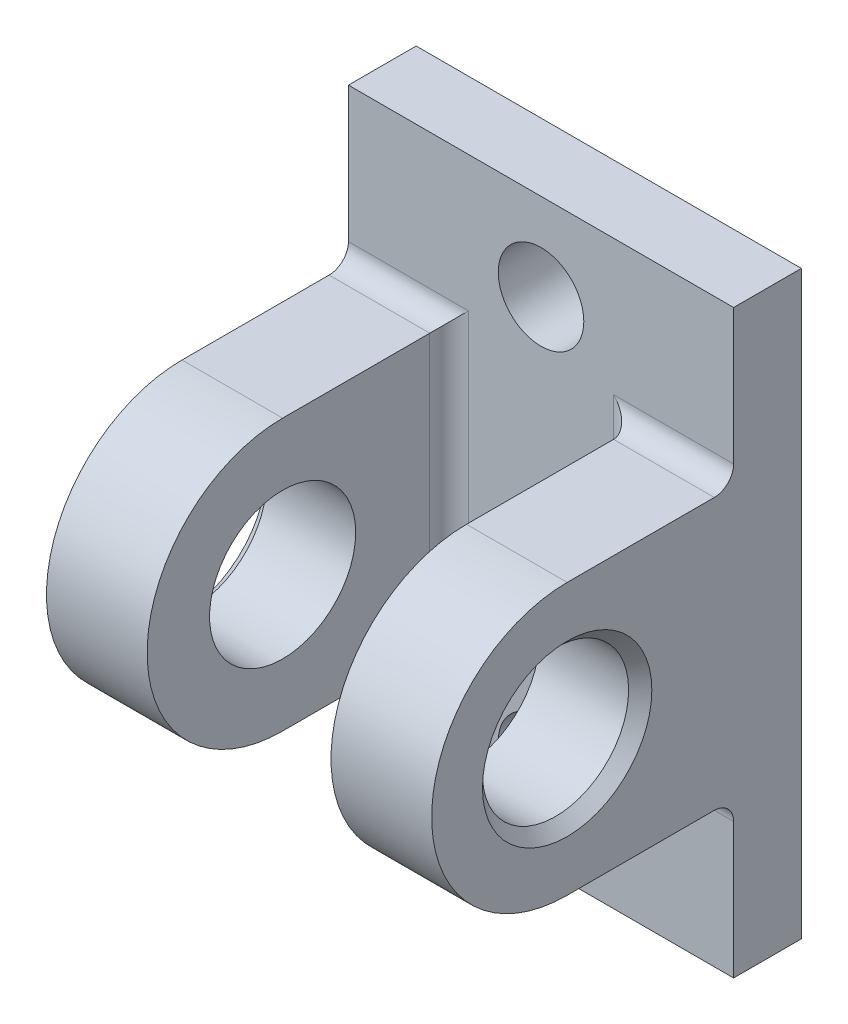
ISO-10303-21;
HEADER;
FILE_DESCRIPTION(('STEP AP214'),'2;1');
FILE_NAME('part.step','',(''),(''),'','','');
FILE_SCHEMA(('AUTOMOTIVE_DESIGN { 1 0 10303 214 1 1 1 1 }'));
ENDSEC;
DATA;
#1=APPLICATION_CONTEXT('core data for automotive mechanical design processes');
#2=APPLICATION_PROTOCOL_DEFINITION('international standard','automotive_design',2000,#1);
#3=PRODUCT_CONTEXT('',#1,'mechanical');
#4=PRODUCT('Part','Part','',(#3));
#5=PRODUCT_RELATED_PRODUCT_CATEGORY('part','',(#4));
#6=PRODUCT_DEFINITION_FORMATION('','',#4);
#7=PRODUCT_DEFINITION_CONTEXT('part definition',#1,'design');
#8=PRODUCT_DEFINITION('design','',#6,#7);
#9=PRODUCT_DEFINITION_SHAPE('','',#8);
#10=(LENGTH_UNIT() NAMED_UNIT(*) SI_UNIT(.MILLI.,.METRE.));
#11=(NAMED_UNIT(*) PLANE_ANGLE_UNIT() SI_UNIT($,.RADIAN.));
#12=(NAMED_UNIT(*) SI_UNIT($,.STERADIAN.) SOLID_ANGLE_UNIT());
#13=UNCERTAINTY_MEASURE_WITH_UNIT(LENGTH_MEASURE(1.E-05),#10,'distance_accuracy_value','');
#14=(GEOMETRIC_REPRESENTATION_CONTEXT(3) GLOBAL_UNCERTAINTY_ASSIGNED_CONTEXT((#13)) GLOBAL_UNIT_ASSIGNED_CONTEXT((#10,
#11,#12)) REPRESENTATION_CONTEXT('',''));
#15=CARTESIAN_POINT('',(0.,0.,0.));
#16=DIRECTION('',(0.,0.,1.));
#17=DIRECTION('',(1.,0.,0.));
#18=AXIS2_PLACEMENT_3D('',#15,#16,#17);
#19=CARTESIAN_POINT('',(-6.03250000000001,0.,15.367));
#20=DIRECTION('',(1.,0.,0.));
#21=DIRECTION('',(0.,0.,-1.));
#22=AXIS2_PLACEMENT_3D('',#19,#20,#21);
#23=CYLINDRICAL_SURFACE('',#22,8.89);
#24=DIRECTION('',(1.,0.,0.));
#25=VECTOR('',#24,1.);
#26=CARTESIAN_POINT('',(-6.03250000000001,-8.89,15.367));
#27=LINE('',#26,#25);
#28=CARTESIAN_POINT('',(-6.03250000000001,-8.89,15.367));
#29=VERTEX_POINT('',#28);
#30=CARTESIAN_POINT('',(-12.6365,-8.89,15.367));
#31=VERTEX_POINT('',#30);
#32=EDGE_CURVE('E355',#29,#31,#27,.F.);
#33=ORIENTED_EDGE('',*,*,#32,.F.);
#34=CARTESIAN_POINT('',(-6.03250000000001,0.,15.367));
#35=DIRECTION('',(-1.,0.,0.));
#36=DIRECTION('',(0.,0.,1.));
#37=AXIS2_PLACEMENT_3D('',#34,#35,#36);
#38=CIRCLE('',#37,8.89);
#39=CARTESIAN_POINT('',(-6.03250000000001,8.89,15.367));
#40=VERTEX_POINT('',#39);
#41=EDGE_CURVE('E359',#40,#29,#38,.F.);
#42=ORIENTED_EDGE('',*,*,#41,.F.);
#43=DIRECTION('',(1.,0.,0.));
#44=VECTOR('',#43,1.);
#45=CARTESIAN_POINT('',(-6.03250000000001,8.89,15.367));
#46=LINE('',#45,#44);
#47=CARTESIAN_POINT('',(-12.6365,8.89,15.367));
#48=VERTEX_POINT('',#47);
#49=EDGE_CURVE('E327',#48,#40,#46,.T.);
#50=ORIENTED_EDGE('',*,*,#49,.F.);
#51=CARTESIAN_POINT('',(-12.6365,0.,15.367));
#52=DIRECTION('',(1.,0.,0.));
#53=DIRECTION('',(0.,0.,-1.));
#54=AXIS2_PLACEMENT_3D('',#51,#52,#53);
#55=CIRCLE('',#54,8.89);
#56=EDGE_CURVE('E360',#31,#48,#55,.F.);
#57=ORIENTED_EDGE('',*,*,#56,.F.);
#58=EDGE_LOOP('',(#33,#42,#50,#57));
#59=FACE_BOUND('',#58,.T.);
#60=ADVANCED_FACE('F34',(#59),#23,.T.);
#61=CARTESIAN_POINT('',(12.6365,0.,15.367));
#62=DIRECTION('',(1.,0.,0.));
#63=DIRECTION('',(0.,0.,-1.));
#64=AXIS2_PLACEMENT_3D('',#61,#62,#63);
#65=CYLINDRICAL_SURFACE('',#64,8.89);
#66=DIRECTION('',(1.,0.,0.));
#67=VECTOR('',#66,1.);
#68=CARTESIAN_POINT('',(6.03250000000001,-8.89,15.367));
#69=LINE('',#68,#67);
#70=CARTESIAN_POINT('',(12.6365,-8.89,15.367));
#71=VERTEX_POINT('',#70);
#72=CARTESIAN_POINT('',(6.03250000000001,-8.89,15.367));
#73=VERTEX_POINT('',#72);
#74=EDGE_CURVE('E178',#71,#73,#69,.F.);
#75=ORIENTED_EDGE('',*,*,#74,.F.);
#76=CARTESIAN_POINT('',(12.6365,0.,15.367));
#77=DIRECTION('',(-1.,0.,0.));
#78=DIRECTION('',(0.,0.,1.));
#79=AXIS2_PLACEMENT_3D('',#76,#77,#78);
#80=CIRCLE('',#79,8.89);
#81=CARTESIAN_POINT('',(12.6365,8.89,15.367));
#82=VERTEX_POINT('',#81);
#83=EDGE_CURVE('E351',#82,#71,#80,.F.);
#84=ORIENTED_EDGE('',*,*,#83,.F.);
#85=DIRECTION('',(1.,0.,0.));
#86=VECTOR('',#85,1.);
#87=CARTESIAN_POINT('',(6.03250000000001,8.89,15.367));
#88=LINE('',#87,#86);
#89=CARTESIAN_POINT('',(6.03250000000001,8.89,15.367));
#90=VERTEX_POINT('',#89);
#91=EDGE_CURVE('E181',#90,#82,#88,.T.);
#92=ORIENTED_EDGE('',*,*,#91,.F.);
#93=CARTESIAN_POINT('',(6.03250000000001,0.,15.367));
#94=DIRECTION('',(1.,0.,0.));
#95=DIRECTION('',(0.,0.,-1.));
#96=AXIS2_PLACEMENT_3D('',#93,#94,#95);
#97=CIRCLE('',#96,8.89);
#98=EDGE_CURVE('E353',#73,#90,#97,.F.);
#99=ORIENTED_EDGE('',*,*,#98,.F.);
#100=EDGE_LOOP('',(#75,#84,#92,#99));
#101=FACE_BOUND('',#100,.T.);
#102=ADVANCED_FACE('F272',(#101),#65,.T.);
#103=CARTESIAN_POINT('',(0.,0.,4.445));
#104=DIRECTION('',(0.,0.,-1.));
#105=DIRECTION('',(-1.,0.,0.));
#106=AXIS2_PLACEMENT_3D('',#103,#104,#105);
#107=PLANE('',#106);
#108=CARTESIAN_POINT('',(0.,-13.335,4.445));
#109=DIRECTION('',(0.,0.,1.));
#110=DIRECTION('',(-1.,0.,0.));
#111=AXIS2_PLACEMENT_3D('',#108,#109,#110);
#112=CIRCLE('',#111,2.8067);
#113=CARTESIAN_POINT('',(-2.8067,-13.335,4.445));
#114=VERTEX_POINT('',#113);
#115=EDGE_CURVE('E445',#114,#114,#112,.T.);
#116=ORIENTED_EDGE('',*,*,#115,.F.);
#117=EDGE_LOOP('',(#116));
#118=FACE_BOUND('',#117,.T.);
#119=CARTESIAN_POINT('',(0.,13.335,4.445));
#120=DIRECTION('',(0.,0.,1.));
#121=DIRECTION('',(1.,0.,0.));
#122=AXIS2_PLACEMENT_3D('',#119,#120,#121);
#123=CIRCLE('',#122,2.8067);
#124=CARTESIAN_POINT('',(2.8067,13.335,4.445));
#125=VERTEX_POINT('',#124);
#126=EDGE_CURVE('E419',#125,#125,#123,.T.);
#127=ORIENTED_EDGE('',*,*,#126,.F.);
#128=EDGE_LOOP('',(#127));
#129=FACE_BOUND('',#128,.T.);
#130=DIRECTION('',(0.,-1.,0.));
#131=VECTOR('',#130,1.);
#132=CARTESIAN_POINT('',(4.76250000000001,8.89,4.445));
#133=LINE('',#132,#131);
#134=CARTESIAN_POINT('',(4.76250000000001,-10.16,4.445));
#135=VERTEX_POINT('',#134);
#136=CARTESIAN_POINT('',(4.76250000000001,10.16,4.445));
#137=VERTEX_POINT('',#136);
#138=EDGE_CURVE('E208',#135,#137,#133,.F.);
#139=ORIENTED_EDGE('',*,*,#138,.T.);
#140=DIRECTION('',(-1.,0.,0.));
#141=VECTOR('',#140,1.);
#142=CARTESIAN_POINT('',(12.6365,10.16,4.445));
#143=LINE('',#142,#141);
#144=CARTESIAN_POINT('',(12.6365,10.16,4.445));
#145=VERTEX_POINT('',#144);
#146=EDGE_CURVE('E156',#137,#145,#143,.F.);
#147=ORIENTED_EDGE('',*,*,#146,.T.);
#148=DIRECTION('',(0.,1.,0.));
#149=VECTOR('',#148,1.);
#150=CARTESIAN_POINT('',(12.6365,-19.05,4.445));
#151=LINE('',#150,#149);
#152=CARTESIAN_POINT('',(12.6365,19.05,4.445));
#153=VERTEX_POINT('',#152);
#154=EDGE_CURVE('E149',#145,#153,#151,.T.);
#155=ORIENTED_EDGE('',*,*,#154,.T.);
#156=DIRECTION('',(-1.,0.,0.));
#157=VECTOR('',#156,1.);
#158=CARTESIAN_POINT('',(-12.6365,19.05,4.445));
#159=LINE('',#158,#157);
#160=CARTESIAN_POINT('',(-12.6365,19.05,4.445));
#161=VERTEX_POINT('',#160);
#162=EDGE_CURVE('E153',#153,#161,#159,.T.);
#163=ORIENTED_EDGE('',*,*,#162,.T.);
#164=DIRECTION('',(0.,-1.,0.));
#165=VECTOR('',#164,1.);
#166=CARTESIAN_POINT('',(-12.6365,-19.05,4.445));
#167=LINE('',#166,#165);
#168=CARTESIAN_POINT('',(-12.6365,10.16,4.445));
#169=VERTEX_POINT('',#168);
#170=EDGE_CURVE('E421',#161,#169,#167,.T.);
#171=ORIENTED_EDGE('',*,*,#170,.T.);
#172=DIRECTION('',(-1.,0.,0.));
#173=VECTOR('',#172,1.);
#174=CARTESIAN_POINT('',(-6.03250000000001,10.16,4.445));
#175=LINE('',#174,#173);
#176=CARTESIAN_POINT('',(-4.76250000000001,10.16,4.445));
#177=VERTEX_POINT('',#176);
#178=EDGE_CURVE('E206',#169,#177,#175,.F.);
#179=ORIENTED_EDGE('',*,*,#178,.T.);
#180=DIRECTION('',(0.,1.,0.));
#181=VECTOR('',#180,1.);
#182=CARTESIAN_POINT('',(-4.76250000000001,-8.89,4.445));
#183=LINE('',#182,#181);
#184=CARTESIAN_POINT('',(-4.76250000000001,-10.16,4.445));
#185=VERTEX_POINT('',#184);
#186=EDGE_CURVE('E204',#177,#185,#183,.F.);
#187=ORIENTED_EDGE('',*,*,#186,.T.);
#188=DIRECTION('',(1.,0.,0.));
#189=VECTOR('',#188,1.);
#190=CARTESIAN_POINT('',(-12.6365,-10.16,4.445));
#191=LINE('',#190,#189);
#192=CARTESIAN_POINT('',(-12.6365,-10.16,4.445));
#193=VERTEX_POINT('',#192);
#194=EDGE_CURVE('E202',#185,#193,#191,.F.);
#195=ORIENTED_EDGE('',*,*,#194,.T.);
#196=CARTESIAN_POINT('',(-12.6365,-19.05,4.445));
#197=VERTEX_POINT('',#196);
#198=EDGE_CURVE('E171',#193,#197,#167,.T.);
#199=ORIENTED_EDGE('',*,*,#198,.T.);
#200=DIRECTION('',(1.,0.,0.));
#201=VECTOR('',#200,1.);
#202=CARTESIAN_POINT('',(-12.6365,-19.05,4.445));
#203=LINE('',#202,#201);
#204=CARTESIAN_POINT('',(12.6365,-19.05,4.445));
#205=VERTEX_POINT('',#204);
#206=EDGE_CURVE('E423',#197,#205,#203,.T.);
#207=ORIENTED_EDGE('',*,*,#206,.T.);
#208=CARTESIAN_POINT('',(12.6365,-10.16,4.445));
#209=VERTEX_POINT('',#208);
#210=EDGE_CURVE('E160',#205,#209,#151,.T.);
#211=ORIENTED_EDGE('',*,*,#210,.T.);
#212=DIRECTION('',(1.,0.,0.));
#213=VECTOR('',#212,1.);
#214=CARTESIAN_POINT('',(6.03250000000001,-10.16,4.445));
#215=LINE('',#214,#213);
#216=EDGE_CURVE('E210',#209,#135,#215,.F.);
#217=ORIENTED_EDGE('',*,*,#216,.T.);
#218=EDGE_LOOP('',(#139,#147,#155,#163,#171,#179,#187,#195,#199,#207,#211,#217));
#219=FACE_BOUND('',#218,.T.);
#220=ADVANCED_FACE('F151',(#118,#129,#219),#107,.F.);
#221=CARTESIAN_POINT('',(12.6365,-19.05,4.445));
#222=DIRECTION('',(-1.,0.,0.));
#223=DIRECTION('',(0.,0.,1.));
#224=AXIS2_PLACEMENT_3D('',#221,#222,#223);
#225=PLANE('',#224);
#226=CARTESIAN_POINT('',(12.6365,0.,15.367));
#227=DIRECTION('',(-1.,0.,0.));
#228=DIRECTION('',(0.,0.,1.));
#229=AXIS2_PLACEMENT_3D('',#226,#227,#228);
#230=CIRCLE('',#229,5.55625000000003);
#231=CARTESIAN_POINT('',(12.6365,0.,20.92325));
#232=VERTEX_POINT('',#231);
#233=EDGE_CURVE('E250',#232,#232,#230,.T.);
#234=ORIENTED_EDGE('',*,*,#233,.T.);
#235=EDGE_LOOP('',(#234));
#236=FACE_BOUND('',#235,.T.);
#237=DIRECTION('',(0.,0.,-1.));
#238=VECTOR('',#237,1.);
#239=CARTESIAN_POINT('',(12.6365,8.89,24.257));
#240=LINE('',#239,#238);
#241=CARTESIAN_POINT('',(12.6365,8.89,5.715));
#242=VERTEX_POINT('',#241);
#243=EDGE_CURVE('E340',#82,#242,#240,.T.);
#244=ORIENTED_EDGE('',*,*,#243,.F.);
#245=ORIENTED_EDGE('',*,*,#83,.T.);
#246=DIRECTION('',(0.,0.,-1.));
#247=VECTOR('',#246,1.);
#248=CARTESIAN_POINT('',(12.6365,-8.89,24.257));
#249=LINE('',#248,#247);
#250=CARTESIAN_POINT('',(12.6365,-8.89,5.715));
#251=VERTEX_POINT('',#250);
#252=EDGE_CURVE('E330',#71,#251,#249,.T.);
#253=ORIENTED_EDGE('',*,*,#252,.T.);
#254=CARTESIAN_POINT('',(12.6365,-10.16,5.715));
#255=DIRECTION('',(-1.,0.,0.));
#256=DIRECTION('',(0.,0.,1.));
#257=AXIS2_PLACEMENT_3D('',#254,#255,#256);
#258=CIRCLE('',#257,1.27);
#259=EDGE_CURVE('E225',#251,#209,#258,.T.);
#260=ORIENTED_EDGE('',*,*,#259,.T.);
#261=ORIENTED_EDGE('',*,*,#210,.F.);
#262=DIRECTION('',(0.,0.,-1.));
#263=VECTOR('',#262,1.);
#264=CARTESIAN_POINT('',(12.6365,-19.05,4.445));
#265=LINE('',#264,#263);
#266=CARTESIAN_POINT('',(12.6365,-19.05,0.));
#267=VERTEX_POINT('',#266);
#268=EDGE_CURVE('E424',#205,#267,#265,.T.);
#269=ORIENTED_EDGE('',*,*,#268,.T.);
#270=DIRECTION('',(0.,1.,0.));
#271=VECTOR('',#270,1.);
#272=CARTESIAN_POINT('',(12.6365,-19.05,0.));
#273=LINE('',#272,#271);
#274=CARTESIAN_POINT('',(12.6365,19.05,0.));
#275=VERTEX_POINT('',#274);
#276=EDGE_CURVE('E177',#267,#275,#273,.T.);
#277=ORIENTED_EDGE('',*,*,#276,.T.);
#278=DIRECTION('',(0.,0.,-1.));
#279=VECTOR('',#278,1.);
#280=CARTESIAN_POINT('',(12.6365,19.05,4.445));
#281=LINE('',#280,#279);
#282=EDGE_CURVE('E166',#153,#275,#281,.T.);
#283=ORIENTED_EDGE('',*,*,#282,.F.);
#284=ORIENTED_EDGE('',*,*,#154,.F.);
#285=CARTESIAN_POINT('',(12.6365,10.16,5.715));
#286=DIRECTION('',(-1.,0.,0.));
#287=DIRECTION('',(0.,0.,1.));
#288=AXIS2_PLACEMENT_3D('',#285,#286,#287);
#289=CIRCLE('',#288,1.27);
#290=EDGE_CURVE('E223',#145,#242,#289,.T.);
#291=ORIENTED_EDGE('',*,*,#290,.T.);
#292=EDGE_LOOP('',(#244,#245,#253,#260,#261,#269,#277,#283,#284,#291));
#293=FACE_BOUND('',#292,.T.);
#294=ADVANCED_FACE('F174',(#236,#293),#225,.F.);
#295=CARTESIAN_POINT('',(-12.6365,19.05,4.445));
#296=DIRECTION('',(0.,-1.,0.));
#297=DIRECTION('',(0.,0.,-1.));
#298=AXIS2_PLACEMENT_3D('',#295,#296,#297);
#299=PLANE('',#298);
#300=DIRECTION('',(-1.,0.,0.));
#301=VECTOR('',#300,1.);
#302=CARTESIAN_POINT('',(-12.6365,19.05,0.));
#303=LINE('',#302,#301);
#304=CARTESIAN_POINT('',(-12.6365,19.05,0.));
#305=VERTEX_POINT('',#304);
#306=EDGE_CURVE('E428',#275,#305,#303,.T.);
#307=ORIENTED_EDGE('',*,*,#306,.T.);
#308=DIRECTION('',(0.,0.,-1.));
#309=VECTOR('',#308,1.);
#310=CARTESIAN_POINT('',(-12.6365,19.05,4.445));
#311=LINE('',#310,#309);
#312=EDGE_CURVE('E169',#161,#305,#311,.T.);
#313=ORIENTED_EDGE('',*,*,#312,.F.);
#314=ORIENTED_EDGE('',*,*,#162,.F.);
#315=ORIENTED_EDGE('',*,*,#282,.T.);
#316=EDGE_LOOP('',(#307,#313,#314,#315));
#317=FACE_BOUND('',#316,.T.);
#318=ADVANCED_FACE('F165',(#317),#299,.F.);
#319=CARTESIAN_POINT('',(-12.6365,-19.05,4.445));
#320=DIRECTION('',(1.,0.,0.));
#321=DIRECTION('',(0.,0.,-1.));
#322=AXIS2_PLACEMENT_3D('',#319,#320,#321);
#323=PLANE('',#322);
#324=CARTESIAN_POINT('',(-12.6365,0.,15.367));
#325=DIRECTION('',(1.,0.,0.));
#326=DIRECTION('',(0.,0.,-1.));
#327=AXIS2_PLACEMENT_3D('',#324,#325,#326);
#328=CIRCLE('',#327,5.55624999999998);
#329=CARTESIAN_POINT('',(-12.6365,0.,9.81075000000002));
#330=VERTEX_POINT('',#329);
#331=EDGE_CURVE('E42',#330,#330,#328,.T.);
#332=ORIENTED_EDGE('',*,*,#331,.T.);
#333=EDGE_LOOP('',(#332));
#334=FACE_BOUND('',#333,.T.);
#335=DIRECTION('',(0.,0.,-1.));
#336=VECTOR('',#335,1.);
#337=CARTESIAN_POINT('',(-12.6365,-8.89,24.257));
#338=LINE('',#337,#336);
#339=CARTESIAN_POINT('',(-12.6365,-8.89,5.715));
#340=VERTEX_POINT('',#339);
#341=EDGE_CURVE('E237',#31,#340,#338,.T.);
#342=ORIENTED_EDGE('',*,*,#341,.F.);
#343=ORIENTED_EDGE('',*,*,#56,.T.);
#344=DIRECTION('',(0.,0.,-1.));
#345=VECTOR('',#344,1.);
#346=CARTESIAN_POINT('',(-12.6365,8.89,24.257));
#347=LINE('',#346,#345);
#348=CARTESIAN_POINT('',(-12.6365,8.89,5.715));
#349=VERTEX_POINT('',#348);
#350=EDGE_CURVE('E328',#48,#349,#347,.T.);
#351=ORIENTED_EDGE('',*,*,#350,.T.);
#352=CARTESIAN_POINT('',(-12.6365,10.16,5.715));
#353=DIRECTION('',(1.,0.,0.));
#354=DIRECTION('',(0.,0.,-1.));
#355=AXIS2_PLACEMENT_3D('',#352,#353,#354);
#356=CIRCLE('',#355,1.27);
#357=EDGE_CURVE('E227',#349,#169,#356,.T.);
#358=ORIENTED_EDGE('',*,*,#357,.T.);
#359=ORIENTED_EDGE('',*,*,#170,.F.);
#360=ORIENTED_EDGE('',*,*,#312,.T.);
#361=DIRECTION('',(0.,-1.,0.));
#362=VECTOR('',#361,1.);
#363=CARTESIAN_POINT('',(-12.6365,-19.05,0.));
#364=LINE('',#363,#362);
#365=CARTESIAN_POINT('',(-12.6365,-19.05,0.));
#366=VERTEX_POINT('',#365);
#367=EDGE_CURVE('E430',#305,#366,#364,.T.);
#368=ORIENTED_EDGE('',*,*,#367,.T.);
#369=DIRECTION('',(0.,0.,-1.));
#370=VECTOR('',#369,1.);
#371=CARTESIAN_POINT('',(-12.6365,-19.05,4.445));
#372=LINE('',#371,#370);
#373=EDGE_CURVE('E183',#197,#366,#372,.T.);
#374=ORIENTED_EDGE('',*,*,#373,.F.);
#375=ORIENTED_EDGE('',*,*,#198,.F.);
#376=CARTESIAN_POINT('',(-12.6365,-10.16,5.715));
#377=DIRECTION('',(1.,0.,0.));
#378=DIRECTION('',(0.,0.,-1.));
#379=AXIS2_PLACEMENT_3D('',#376,#377,#378);
#380=CIRCLE('',#379,1.27);
#381=EDGE_CURVE('E49',#193,#340,#380,.T.);
#382=ORIENTED_EDGE('',*,*,#381,.T.);
#383=EDGE_LOOP('',(#342,#343,#351,#358,#359,#360,#368,#374,#375,#382));
#384=FACE_BOUND('',#383,.T.);
#385=ADVANCED_FACE('F255',(#334,#384),#323,.F.);
#386=CARTESIAN_POINT('',(-12.6365,-19.05,4.445));
#387=DIRECTION('',(0.,1.,0.));
#388=DIRECTION('',(0.,0.,1.));
#389=AXIS2_PLACEMENT_3D('',#386,#387,#388);
#390=PLANE('',#389);
#391=DIRECTION('',(1.,0.,0.));
#392=VECTOR('',#391,1.);
#393=CARTESIAN_POINT('',(-12.6365,-19.05,0.));
#394=LINE('',#393,#392);
#395=EDGE_CURVE('E161',#366,#267,#394,.T.);
#396=ORIENTED_EDGE('',*,*,#395,.T.);
#397=ORIENTED_EDGE('',*,*,#268,.F.);
#398=ORIENTED_EDGE('',*,*,#206,.F.);
#399=ORIENTED_EDGE('',*,*,#373,.T.);
#400=EDGE_LOOP('',(#396,#397,#398,#399));
#401=FACE_BOUND('',#400,.T.);
#402=ADVANCED_FACE('F396',(#401),#390,.F.);
#403=CARTESIAN_POINT('',(0.,0.,0.));
#404=DIRECTION('',(0.,0.,-1.));
#405=DIRECTION('',(-1.,0.,0.));
#406=AXIS2_PLACEMENT_3D('',#403,#404,#405);
#407=PLANE('',#406);
#408=CARTESIAN_POINT('',(0.,-13.335,0.));
#409=DIRECTION('',(0.,0.,1.));
#410=DIRECTION('',(-1.,0.,0.));
#411=AXIS2_PLACEMENT_3D('',#408,#409,#410);
#412=CIRCLE('',#411,2.8067);
#413=CARTESIAN_POINT('',(-2.8067,-13.335,0.));
#414=VERTEX_POINT('',#413);
#415=EDGE_CURVE('E442',#414,#414,#412,.T.);
#416=ORIENTED_EDGE('',*,*,#415,.T.);
#417=EDGE_LOOP('',(#416));
#418=FACE_BOUND('',#417,.T.);
#419=CARTESIAN_POINT('',(0.,13.335,0.));
#420=DIRECTION('',(0.,0.,1.));
#421=DIRECTION('',(1.,0.,0.));
#422=AXIS2_PLACEMENT_3D('',#419,#420,#421);
#423=CIRCLE('',#422,2.8067);
#424=CARTESIAN_POINT('',(2.8067,13.335,0.));
#425=VERTEX_POINT('',#424);
#426=EDGE_CURVE('E247',#425,#425,#423,.T.);
#427=ORIENTED_EDGE('',*,*,#426,.T.);
#428=EDGE_LOOP('',(#427));
#429=FACE_BOUND('',#428,.T.);
#430=ORIENTED_EDGE('',*,*,#276,.F.);
#431=ORIENTED_EDGE('',*,*,#395,.F.);
#432=ORIENTED_EDGE('',*,*,#367,.F.);
#433=ORIENTED_EDGE('',*,*,#306,.F.);
#434=EDGE_LOOP('',(#430,#431,#432,#433));
#435=FACE_BOUND('',#434,.T.);
#436=ADVANCED_FACE('F390',(#418,#429,#435),#407,.T.);
#437=CARTESIAN_POINT('',(6.03250000000001,8.89,24.257));
#438=DIRECTION('',(0.,-1.,0.));
#439=DIRECTION('',(0.,0.,-1.));
#440=AXIS2_PLACEMENT_3D('',#437,#438,#439);
#441=PLANE('',#440);
#442=ORIENTED_EDGE('',*,*,#243,.T.);
#443=DIRECTION('',(-1.,0.,0.));
#444=VECTOR('',#443,1.);
#445=CARTESIAN_POINT('',(6.03250000000001,8.89,5.715));
#446=LINE('',#445,#444);
#447=CARTESIAN_POINT('',(6.03250000000001,8.89,5.715));
#448=VERTEX_POINT('',#447);
#449=EDGE_CURVE('E200',#242,#448,#446,.T.);
#450=ORIENTED_EDGE('',*,*,#449,.T.);
#451=DIRECTION('',(0.,0.,-1.));
#452=VECTOR('',#451,1.);
#453=CARTESIAN_POINT('',(6.03250000000001,8.89,24.257));
#454=LINE('',#453,#452);
#455=EDGE_CURVE('E194',#90,#448,#454,.T.);
#456=ORIENTED_EDGE('',*,*,#455,.F.);
#457=ORIENTED_EDGE('',*,*,#91,.T.);
#458=EDGE_LOOP('',(#442,#450,#456,#457));
#459=FACE_BOUND('',#458,.T.);
#460=ADVANCED_FACE('F365',(#459),#441,.F.);
#461=CARTESIAN_POINT('',(6.03250000000001,-8.89,24.257));
#462=DIRECTION('',(1.,0.,0.));
#463=DIRECTION('',(0.,0.,-1.));
#464=AXIS2_PLACEMENT_3D('',#461,#462,#463);
#465=PLANE('',#464);
#466=CARTESIAN_POINT('',(6.03250000000001,0.,15.367));
#467=DIRECTION('',(1.,0.,0.));
#468=DIRECTION('',(0.,0.,-1.));
#469=AXIS2_PLACEMENT_3D('',#466,#467,#468);
#470=CIRCLE('',#469,4.79425);
#471=CARTESIAN_POINT('',(6.0325,0.,10.57275));
#472=VERTEX_POINT('',#471);
#473=EDGE_CURVE('E241',#472,#472,#470,.T.);
#474=ORIENTED_EDGE('',*,*,#473,.T.);
#475=EDGE_LOOP('',(#474));
#476=FACE_BOUND('',#475,.T.);
#477=ORIENTED_EDGE('',*,*,#455,.T.);
#478=DIRECTION('',(0.,-1.,0.));
#479=VECTOR('',#478,1.);
#480=CARTESIAN_POINT('',(6.03250000000001,-8.89,5.715));
#481=LINE('',#480,#479);
#482=CARTESIAN_POINT('',(6.03250000000001,-8.89,5.715));
#483=VERTEX_POINT('',#482);
#484=EDGE_CURVE('E215',#448,#483,#481,.T.);
#485=ORIENTED_EDGE('',*,*,#484,.T.);
#486=DIRECTION('',(0.,0.,-1.));
#487=VECTOR('',#486,1.);
#488=CARTESIAN_POINT('',(6.03250000000001,-8.89,24.257));
#489=LINE('',#488,#487);
#490=EDGE_CURVE('E334',#73,#483,#489,.T.);
#491=ORIENTED_EDGE('',*,*,#490,.F.);
#492=ORIENTED_EDGE('',*,*,#98,.T.);
#493=EDGE_LOOP('',(#477,#485,#491,#492));
#494=FACE_BOUND('',#493,.T.);
#495=ADVANCED_FACE('F367',(#476,#494),#465,.F.);
#496=CARTESIAN_POINT('',(6.03250000000001,-8.89,24.257));
#497=DIRECTION('',(0.,1.,0.));
#498=DIRECTION('',(0.,0.,1.));
#499=AXIS2_PLACEMENT_3D('',#496,#497,#498);
#500=PLANE('',#499);
#501=ORIENTED_EDGE('',*,*,#490,.T.);
#502=DIRECTION('',(1.,0.,0.));
#503=VECTOR('',#502,1.);
#504=CARTESIAN_POINT('',(12.6365,-8.89,5.715));
#505=LINE('',#504,#503);
#506=EDGE_CURVE('E213',#483,#251,#505,.T.);
#507=ORIENTED_EDGE('',*,*,#506,.T.);
#508=ORIENTED_EDGE('',*,*,#252,.F.);
#509=ORIENTED_EDGE('',*,*,#74,.T.);
#510=EDGE_LOOP('',(#501,#507,#508,#509));
#511=FACE_BOUND('',#510,.T.);
#512=ADVANCED_FACE('F375',(#511),#500,.F.);
#513=CARTESIAN_POINT('',(-6.03250000000001,-8.89,24.257));
#514=DIRECTION('',(0.,1.,0.));
#515=DIRECTION('',(0.,0.,1.));
#516=AXIS2_PLACEMENT_3D('',#513,#514,#515);
#517=PLANE('',#516);
#518=ORIENTED_EDGE('',*,*,#341,.T.);
#519=DIRECTION('',(1.,0.,0.));
#520=VECTOR('',#519,1.);
#521=CARTESIAN_POINT('',(-6.03250000000001,-8.89,5.715));
#522=LINE('',#521,#520);
#523=CARTESIAN_POINT('',(-6.03250000000001,-8.89,5.715));
#524=VERTEX_POINT('',#523);
#525=EDGE_CURVE('E56',#340,#524,#522,.T.);
#526=ORIENTED_EDGE('',*,*,#525,.T.);
#527=DIRECTION('',(0.,0.,-1.));
#528=VECTOR('',#527,1.);
#529=CARTESIAN_POINT('',(-6.03250000000001,-8.89,24.257));
#530=LINE('',#529,#528);
#531=EDGE_CURVE('E321',#29,#524,#530,.T.);
#532=ORIENTED_EDGE('',*,*,#531,.F.);
#533=ORIENTED_EDGE('',*,*,#32,.T.);
#534=EDGE_LOOP('',(#518,#526,#532,#533));
#535=FACE_BOUND('',#534,.T.);
#536=ADVANCED_FACE('F377',(#535),#517,.F.);
#537=CARTESIAN_POINT('',(-6.03250000000001,-8.89,24.257));
#538=DIRECTION('',(-1.,0.,0.));
#539=DIRECTION('',(0.,0.,1.));
#540=AXIS2_PLACEMENT_3D('',#537,#538,#539);
#541=PLANE('',#540);
#542=CARTESIAN_POINT('',(-6.03250000000001,0.,15.367));
#543=DIRECTION('',(-1.,0.,0.));
#544=DIRECTION('',(0.,0.,1.));
#545=AXIS2_PLACEMENT_3D('',#542,#543,#544);
#546=CIRCLE('',#545,4.79425);
#547=CARTESIAN_POINT('',(-6.03250000000001,0.,10.57275));
#548=VERTEX_POINT('',#547);
#549=EDGE_CURVE('E244',#548,#548,#546,.T.);
#550=ORIENTED_EDGE('',*,*,#549,.T.);
#551=EDGE_LOOP('',(#550));
#552=FACE_BOUND('',#551,.T.);
#553=ORIENTED_EDGE('',*,*,#531,.T.);
#554=DIRECTION('',(0.,1.,0.));
#555=VECTOR('',#554,1.);
#556=CARTESIAN_POINT('',(-6.03250000000001,8.89,5.715));
#557=LINE('',#556,#555);
#558=CARTESIAN_POINT('',(-6.03250000000001,8.89,5.715));
#559=VERTEX_POINT('',#558);
#560=EDGE_CURVE('E220',#524,#559,#557,.T.);
#561=ORIENTED_EDGE('',*,*,#560,.T.);
#562=DIRECTION('',(0.,0.,-1.));
#563=VECTOR('',#562,1.);
#564=CARTESIAN_POINT('',(-6.03250000000001,8.89,24.257));
#565=LINE('',#564,#563);
#566=EDGE_CURVE('E320',#40,#559,#565,.T.);
#567=ORIENTED_EDGE('',*,*,#566,.F.);
#568=ORIENTED_EDGE('',*,*,#41,.T.);
#569=EDGE_LOOP('',(#553,#561,#567,#568));
#570=FACE_BOUND('',#569,.T.);
#571=ADVANCED_FACE('F319',(#552,#570),#541,.F.);
#572=CARTESIAN_POINT('',(-6.03250000000001,8.89,24.257));
#573=DIRECTION('',(0.,-1.,0.));
#574=DIRECTION('',(0.,0.,-1.));
#575=AXIS2_PLACEMENT_3D('',#572,#573,#574);
#576=PLANE('',#575);
#577=ORIENTED_EDGE('',*,*,#566,.T.);
#578=DIRECTION('',(-1.,0.,0.));
#579=VECTOR('',#578,1.);
#580=CARTESIAN_POINT('',(-12.6365,8.89,5.715));
#581=LINE('',#580,#579);
#582=EDGE_CURVE('E217',#559,#349,#581,.T.);
#583=ORIENTED_EDGE('',*,*,#582,.T.);
#584=ORIENTED_EDGE('',*,*,#350,.F.);
#585=ORIENTED_EDGE('',*,*,#49,.T.);
#586=EDGE_LOOP('',(#577,#583,#584,#585));
#587=FACE_BOUND('',#586,.T.);
#588=ADVANCED_FACE('F295',(#587),#576,.F.);
#589=CARTESIAN_POINT('',(6.03250000000001,-10.16,5.715));
#590=DIRECTION('',(-1.,0.,0.));
#591=DIRECTION('',(0.,0.,1.));
#592=AXIS2_PLACEMENT_3D('',#589,#590,#591);
#593=CYLINDRICAL_SURFACE('',#592,1.27);
#594=ORIENTED_EDGE('',*,*,#259,.F.);
#595=ORIENTED_EDGE('',*,*,#506,.F.);
#596=CARTESIAN_POINT('',(4.76250000000001,-10.16,5.715));
#597=DIRECTION('',(-0.707106781186547,0.707106781186547,0.));
#598=DIRECTION('',(0.707106781186547,0.707106781186547,0.));
#599=AXIS2_PLACEMENT_3D('',#596,#597,#598);
#600=ELLIPSE('',#599,1.79605122421383,1.27);
#601=EDGE_CURVE('E233',#135,#483,#600,.F.);
#602=ORIENTED_EDGE('',*,*,#601,.F.);
#603=ORIENTED_EDGE('',*,*,#216,.F.);
#604=EDGE_LOOP('',(#594,#595,#602,#603));
#605=FACE_BOUND('',#604,.T.);
#606=ADVANCED_FACE('F291',(#605),#593,.F.);
#607=CARTESIAN_POINT('',(4.76250000000001,-8.89,5.715));
#608=DIRECTION('',(0.,1.,0.));
#609=DIRECTION('',(0.,0.,1.));
#610=AXIS2_PLACEMENT_3D('',#607,#608,#609);
#611=CYLINDRICAL_SURFACE('',#610,1.27);
#612=ORIENTED_EDGE('',*,*,#601,.T.);
#613=ORIENTED_EDGE('',*,*,#484,.F.);
#614=CARTESIAN_POINT('',(4.76250000000001,10.16,5.715));
#615=DIRECTION('',(0.707106781186547,0.707106781186547,0.));
#616=DIRECTION('',(-0.707106781186547,0.707106781186547,0.));
#617=AXIS2_PLACEMENT_3D('',#614,#615,#616);
#618=ELLIPSE('',#617,1.79605122421383,1.27);
#619=EDGE_CURVE('E231',#137,#448,#618,.F.);
#620=ORIENTED_EDGE('',*,*,#619,.F.);
#621=ORIENTED_EDGE('',*,*,#138,.F.);
#622=EDGE_LOOP('',(#612,#613,#620,#621));
#623=FACE_BOUND('',#622,.T.);
#624=ADVANCED_FACE('F287',(#623),#611,.F.);
#625=CARTESIAN_POINT('',(6.03250000000001,10.16,5.715));
#626=DIRECTION('',(1.,0.,0.));
#627=DIRECTION('',(0.,0.,-1.));
#628=AXIS2_PLACEMENT_3D('',#625,#626,#627);
#629=CYLINDRICAL_SURFACE('',#628,1.27);
#630=ORIENTED_EDGE('',*,*,#290,.F.);
#631=ORIENTED_EDGE('',*,*,#146,.F.);
#632=ORIENTED_EDGE('',*,*,#619,.T.);
#633=ORIENTED_EDGE('',*,*,#449,.F.);
#634=EDGE_LOOP('',(#630,#631,#632,#633));
#635=FACE_BOUND('',#634,.T.);
#636=ADVANCED_FACE('F283',(#635),#629,.F.);
#637=CARTESIAN_POINT('',(-6.03250000000001,-10.16,5.715));
#638=DIRECTION('',(-1.,0.,0.));
#639=DIRECTION('',(0.,0.,1.));
#640=AXIS2_PLACEMENT_3D('',#637,#638,#639);
#641=CYLINDRICAL_SURFACE('',#640,1.27);
#642=ORIENTED_EDGE('',*,*,#381,.F.);
#643=ORIENTED_EDGE('',*,*,#194,.F.);
#644=CARTESIAN_POINT('',(-4.76250000000001,-10.16,5.715));
#645=DIRECTION('',(-0.707106781186547,-0.707106781186547,0.));
#646=DIRECTION('',(-0.707106781186547,0.707106781186547,0.));
#647=AXIS2_PLACEMENT_3D('',#644,#645,#646);
#648=ELLIPSE('',#647,1.79605122421383,1.27);
#649=EDGE_CURVE('E234',#524,#185,#648,.T.);
#650=ORIENTED_EDGE('',*,*,#649,.F.);
#651=ORIENTED_EDGE('',*,*,#525,.F.);
#652=EDGE_LOOP('',(#642,#643,#650,#651));
#653=FACE_BOUND('',#652,.T.);
#654=ADVANCED_FACE('F286',(#653),#641,.F.);
#655=CARTESIAN_POINT('',(-4.76250000000001,-8.89,5.715));
#656=DIRECTION('',(0.,-1.,0.));
#657=DIRECTION('',(0.,0.,-1.));
#658=AXIS2_PLACEMENT_3D('',#655,#656,#657);
#659=CYLINDRICAL_SURFACE('',#658,1.27);
#660=ORIENTED_EDGE('',*,*,#649,.T.);
#661=ORIENTED_EDGE('',*,*,#186,.F.);
#662=CARTESIAN_POINT('',(-4.76250000000001,10.16,5.715));
#663=DIRECTION('',(0.707106781186547,-0.707106781186547,0.));
#664=DIRECTION('',(-0.707106781186547,-0.707106781186547,0.));
#665=AXIS2_PLACEMENT_3D('',#662,#663,#664);
#666=ELLIPSE('',#665,1.79605122421383,1.27);
#667=EDGE_CURVE('E238',#559,#177,#666,.T.);
#668=ORIENTED_EDGE('',*,*,#667,.F.);
#669=ORIENTED_EDGE('',*,*,#560,.F.);
#670=EDGE_LOOP('',(#660,#661,#668,#669));
#671=FACE_BOUND('',#670,.T.);
#672=ADVANCED_FACE('F301',(#671),#659,.F.);
#673=CARTESIAN_POINT('',(-6.03250000000001,10.16,5.715));
#674=DIRECTION('',(1.,0.,0.));
#675=DIRECTION('',(0.,0.,-1.));
#676=AXIS2_PLACEMENT_3D('',#673,#674,#675);
#677=CYLINDRICAL_SURFACE('',#676,1.27);
#678=ORIENTED_EDGE('',*,*,#667,.T.);
#679=ORIENTED_EDGE('',*,*,#178,.F.);
#680=ORIENTED_EDGE('',*,*,#357,.F.);
#681=ORIENTED_EDGE('',*,*,#582,.F.);
#682=EDGE_LOOP('',(#678,#679,#680,#681));
#683=FACE_BOUND('',#682,.T.);
#684=ADVANCED_FACE('F297',(#683),#677,.F.);
#685=CARTESIAN_POINT('',(-12.6365,0.,15.367));
#686=DIRECTION('',(1.,0.,0.));
#687=DIRECTION('',(0.,0.,-1.));
#688=AXIS2_PLACEMENT_3D('',#685,#686,#687);
#689=CYLINDRICAL_SURFACE('',#688,4.79425);
#690=CARTESIAN_POINT('',(-11.8745,0.,15.367));
#691=DIRECTION('',(1.,0.,0.));
#692=DIRECTION('',(0.,0.,-1.));
#693=AXIS2_PLACEMENT_3D('',#690,#691,#692);
#694=CIRCLE('',#693,4.79425);
#695=CARTESIAN_POINT('',(-11.8745,0.,10.57275));
#696=VERTEX_POINT('',#695);
#697=EDGE_CURVE('E11',#696,#696,#694,.F.);
#698=CARTESIAN_POINT('',(-11.8745,0.,10.57275));
#699=CARTESIAN_POINT('',(-11.8136458333334,0.,10.57275));
#700=CARTESIAN_POINT('',(-11.7527916666667,0.,10.57275));
#701=CARTESIAN_POINT('',(-11.6310833333334,0.,10.57275));
#702=CARTESIAN_POINT('',(-11.5702291666667,0.,10.57275));
#703=CARTESIAN_POINT('',(-11.4485208333334,0.,10.57275));
#704=CARTESIAN_POINT('',(-11.3876666666667,0.,10.57275));
#705=CARTESIAN_POINT('',(-11.2659583333333,0.,10.57275));
#706=CARTESIAN_POINT('',(-11.2051041666667,0.,10.57275));
#707=CARTESIAN_POINT('',(-11.0833958333334,0.,10.57275));
#708=CARTESIAN_POINT('',(-11.0225416666667,0.,10.57275));
#709=CARTESIAN_POINT('',(-10.9008333333333,0.,10.57275));
#710=CARTESIAN_POINT('',(-10.8399791666667,0.,10.57275));
#711=CARTESIAN_POINT('',(-10.7182708333333,0.,10.57275));
#712=CARTESIAN_POINT('',(-10.6574166666667,0.,10.57275));
#713=CARTESIAN_POINT('',(-10.5357083333333,0.,10.57275));
#714=CARTESIAN_POINT('',(-10.4748541666667,0.,10.57275));
#715=CARTESIAN_POINT('',(-10.3531458333333,0.,10.57275));
#716=CARTESIAN_POINT('',(-10.2922916666667,0.,10.57275));
#717=CARTESIAN_POINT('',(-10.1705833333333,0.,10.57275));
#718=CARTESIAN_POINT('',(-10.1097291666667,0.,10.57275));
#719=CARTESIAN_POINT('',(-9.98802083333335,0.,10.57275));
#720=CARTESIAN_POINT('',(-9.92716666666668,0.,10.57275));
#721=CARTESIAN_POINT('',(-9.80545833333335,0.,10.57275));
#722=CARTESIAN_POINT('',(-9.74460416666668,0.,10.57275));
#723=CARTESIAN_POINT('',(-9.62289583333335,0.,10.57275));
#724=CARTESIAN_POINT('',(-9.56204166666668,0.,10.57275));
#725=CARTESIAN_POINT('',(-9.44033333333335,0.,10.57275));
#726=CARTESIAN_POINT('',(-9.37947916666668,0.,10.57275));
#727=CARTESIAN_POINT('',(-9.25777083333335,0.,10.57275));
#728=CARTESIAN_POINT('',(-9.19691666666668,0.,10.57275));
#729=CARTESIAN_POINT('',(-9.07520833333334,0.,10.57275));
#730=CARTESIAN_POINT('',(-9.01435416666668,0.,10.57275));
#731=CARTESIAN_POINT('',(-8.89264583333334,0.,10.57275));
#732=CARTESIAN_POINT('',(-8.83179166666668,0.,10.57275));
#733=CARTESIAN_POINT('',(-8.71008333333335,0.,10.57275));
#734=CARTESIAN_POINT('',(-8.64922916666668,0.,10.57275));
#735=CARTESIAN_POINT('',(-8.52752083333334,0.,10.57275));
#736=CARTESIAN_POINT('',(-8.46666666666668,0.,10.57275));
#737=CARTESIAN_POINT('',(-8.34495833333335,0.,10.57275));
#738=CARTESIAN_POINT('',(-8.28410416666668,0.,10.57275));
#739=CARTESIAN_POINT('',(-8.16239583333334,0.,10.57275));
#740=CARTESIAN_POINT('',(-8.10154166666668,0.,10.57275));
#741=CARTESIAN_POINT('',(-7.97983333333334,0.,10.57275));
#742=CARTESIAN_POINT('',(-7.91897916666668,0.,10.57275));
#743=CARTESIAN_POINT('',(-7.79727083333334,0.,10.57275));
#744=CARTESIAN_POINT('',(-7.73641666666668,0.,10.57275));
#745=CARTESIAN_POINT('',(-7.61470833333334,0.,10.57275));
#746=CARTESIAN_POINT('',(-7.55385416666668,0.,10.57275));
#747=CARTESIAN_POINT('',(-7.43214583333334,0.,10.57275));
#748=CARTESIAN_POINT('',(-7.37129166666668,0.,10.57275));
#749=CARTESIAN_POINT('',(-7.24958333333334,0.,10.57275));
#750=CARTESIAN_POINT('',(-7.18872916666667,0.,10.57275));
#751=CARTESIAN_POINT('',(-7.06702083333334,0.,10.57275));
#752=CARTESIAN_POINT('',(-7.00616666666667,0.,10.57275));
#753=CARTESIAN_POINT('',(-6.88445833333334,0.,10.57275));
#754=CARTESIAN_POINT('',(-6.82360416666667,0.,10.57275));
#755=CARTESIAN_POINT('',(-6.70189583333334,0.,10.57275));
#756=CARTESIAN_POINT('',(-6.64104166666667,0.,10.57275));
#757=CARTESIAN_POINT('',(-6.51933333333334,0.,10.57275));
#758=CARTESIAN_POINT('',(-6.45847916666667,0.,10.57275));
#759=CARTESIAN_POINT('',(-6.33677083333334,0.,10.57275));
#760=CARTESIAN_POINT('',(-6.27591666666667,0.,10.57275));
#761=CARTESIAN_POINT('',(-6.15420833333334,0.,10.57275));
#762=CARTESIAN_POINT('',(-6.09335416666667,0.,10.57275));
#763=CARTESIAN_POINT('',(-6.03250000000001,0.,10.57275));
#764=B_SPLINE_CURVE_WITH_KNOTS('',3,(#698,#699,#700,#701,#702,#703,#704,#705,#706,#707,#708,
#709,#710,#711,#712,#713,#714,#715,#716,#717,#718,#719,#720,#721,#722,#723,#724,#725,#726,#727,
#728,#729,#730,#731,#732,#733,#734,#735,#736,#737,#738,#739,#740,#741,#742,#743,#744,#745,#746,
#747,#748,#749,#750,#751,#752,#753,#754,#755,#756,#757,#758,#759,#760,#761,#762,#763),
.UNSPECIFIED.,.F.,.F.,(4,2,2,2,2,2,2,2,2,2,2,2,2,2,2,2,2,2,2,2,2,2,2,2,2,2,2,2,2,2,2,2,4),(0.,
0.1825625,0.365125000000001,0.547687500000001,0.730250000000002,0.912812500000002,1.095375,
1.2779375,1.4605,1.6430625,1.825625,2.0081875,2.19075000000001,2.37331250000001,
2.55587500000001,2.73843750000001,2.92100000000001,3.10356250000001,3.28612500000001,
3.46868750000001,3.65125000000001,3.83381250000001,4.01637500000001,4.19893750000001,
4.38150000000001,4.56406250000001,4.74662500000001,4.92918750000001,5.11175000000001,
5.29431250000001,5.47687500000001,5.65943750000001,5.84200000000001),.UNSPECIFIED.);
#765=EDGE_CURVE('BSEAM300',#696,#548,#764,.T.);
#766=ORIENTED_EDGE('',*,*,#697,.T.);
#767=ORIENTED_EDGE('',*,*,#549,.F.);
#768=ORIENTED_EDGE('',*,*,#765,.T.);
#769=ORIENTED_EDGE('',*,*,#765,.F.);
#770=EDGE_LOOP('',(#766,#768,#767,#769));
#771=FACE_BOUND('',#770,.T.);
#772=ADVANCED_FACE('F300',(#771),#689,.F.);
#773=CARTESIAN_POINT('',(11.8745,0.,15.367));
#774=DIRECTION('',(-1.,0.,0.));
#775=DIRECTION('',(0.,0.,1.));
#776=AXIS2_PLACEMENT_3D('',#773,#774,#775);
#777=CIRCLE('',#776,4.79425);
#778=CARTESIAN_POINT('',(11.8745,0.,10.57275));
#779=VERTEX_POINT('',#778);
#780=EDGE_CURVE('E230',#779,#779,#777,.F.);
#781=CARTESIAN_POINT('',(11.8745,0.,10.57275));
#782=CARTESIAN_POINT('',(11.8136458333333,0.,10.57275));
#783=CARTESIAN_POINT('',(11.7527916666666,0.,10.57275));
#784=CARTESIAN_POINT('',(11.6310833333333,0.,10.57275));
#785=CARTESIAN_POINT('',(11.5702291666666,0.,10.57275));
#786=CARTESIAN_POINT('',(11.4485208333333,0.,10.57275));
#787=CARTESIAN_POINT('',(11.3876666666667,0.,10.57275));
#788=CARTESIAN_POINT('',(11.2659583333333,0.,10.57275));
#789=CARTESIAN_POINT('',(11.2051041666667,0.,10.57275));
#790=CARTESIAN_POINT('',(11.0833958333333,0.,10.57275));
#791=CARTESIAN_POINT('',(11.0225416666667,0.,10.57275));
#792=CARTESIAN_POINT('',(10.9008333333333,0.,10.57275));
#793=CARTESIAN_POINT('',(10.8399791666667,0.,10.57275));
#794=CARTESIAN_POINT('',(10.7182708333333,0.,10.57275));
#795=CARTESIAN_POINT('',(10.6574166666667,0.,10.57275));
#796=CARTESIAN_POINT('',(10.5357083333333,0.,10.57275));
#797=CARTESIAN_POINT('',(10.4748541666667,0.,10.57275));
#798=CARTESIAN_POINT('',(10.3531458333333,0.,10.57275));
#799=CARTESIAN_POINT('',(10.2922916666667,0.,10.57275));
#800=CARTESIAN_POINT('',(10.1705833333333,0.,10.57275));
#801=CARTESIAN_POINT('',(10.1097291666667,0.,10.57275));
#802=CARTESIAN_POINT('',(9.98802083333332,0.,10.57275));
#803=CARTESIAN_POINT('',(9.92716666666666,0.,10.57275));
#804=CARTESIAN_POINT('',(9.80545833333332,0.,10.57275));
#805=CARTESIAN_POINT('',(9.74460416666666,0.,10.57275));
#806=CARTESIAN_POINT('',(9.62289583333332,0.,10.57275));
#807=CARTESIAN_POINT('',(9.56204166666666,0.,10.57275));
#808=CARTESIAN_POINT('',(9.44033333333332,0.,10.57275));
#809=CARTESIAN_POINT('',(9.37947916666666,0.,10.57275));
#810=CARTESIAN_POINT('',(9.25777083333332,0.,10.57275));
#811=CARTESIAN_POINT('',(9.19691666666666,0.,10.57275));
#812=CARTESIAN_POINT('',(9.07520833333333,0.,10.57275));
#813=CARTESIAN_POINT('',(9.01435416666666,0.,10.57275));
#814=CARTESIAN_POINT('',(8.89264583333333,0.,10.57275));
#815=CARTESIAN_POINT('',(8.83179166666666,0.,10.57275));
#816=CARTESIAN_POINT('',(8.71008333333333,0.,10.57275));
#817=CARTESIAN_POINT('',(8.64922916666666,0.,10.57275));
#818=CARTESIAN_POINT('',(8.52752083333333,0.,10.57275));
#819=CARTESIAN_POINT('',(8.46666666666666,0.,10.57275));
#820=CARTESIAN_POINT('',(8.34495833333333,0.,10.57275));
#821=CARTESIAN_POINT('',(8.28410416666666,0.,10.57275));
#822=CARTESIAN_POINT('',(8.16239583333333,0.,10.57275));
#823=CARTESIAN_POINT('',(8.10154166666666,0.,10.57275));
#824=CARTESIAN_POINT('',(7.97983333333333,0.,10.57275));
#825=CARTESIAN_POINT('',(7.91897916666666,0.,10.57275));
#826=CARTESIAN_POINT('',(7.79727083333333,0.,10.57275));
#827=CARTESIAN_POINT('',(7.73641666666666,0.,10.57275));
#828=CARTESIAN_POINT('',(7.61470833333333,0.,10.57275));
#829=CARTESIAN_POINT('',(7.55385416666667,0.,10.57275));
#830=CARTESIAN_POINT('',(7.43214583333333,0.,10.57275));
#831=CARTESIAN_POINT('',(7.37129166666667,0.,10.57275));
#832=CARTESIAN_POINT('',(7.24958333333333,0.,10.57275));
#833=CARTESIAN_POINT('',(7.18872916666667,0.,10.57275));
#834=CARTESIAN_POINT('',(7.06702083333333,0.,10.57275));
#835=CARTESIAN_POINT('',(7.00616666666667,0.,10.57275));
#836=CARTESIAN_POINT('',(6.88445833333334,0.,10.57275));
#837=CARTESIAN_POINT('',(6.82360416666667,0.,10.57275));
#838=CARTESIAN_POINT('',(6.70189583333334,0.,10.57275));
#839=CARTESIAN_POINT('',(6.64104166666667,0.,10.57275));
#840=CARTESIAN_POINT('',(6.51933333333334,0.,10.57275));
#841=CARTESIAN_POINT('',(6.45847916666667,0.,10.57275));
#842=CARTESIAN_POINT('',(6.33677083333334,0.,10.57275));
#843=CARTESIAN_POINT('',(6.27591666666667,0.,10.57275));
#844=CARTESIAN_POINT('',(6.15420833333334,0.,10.57275));
#845=CARTESIAN_POINT('',(6.09335416666667,0.,10.57275));
#846=CARTESIAN_POINT('',(6.0325,0.,10.57275));
#847=B_SPLINE_CURVE_WITH_KNOTS('',3,(#781,#782,#783,#784,#785,#786,#787,#788,#789,#790,#791,
#792,#793,#794,#795,#796,#797,#798,#799,#800,#801,#802,#803,#804,#805,#806,#807,#808,#809,#810,
#811,#812,#813,#814,#815,#816,#817,#818,#819,#820,#821,#822,#823,#824,#825,#826,#827,#828,#829,
#830,#831,#832,#833,#834,#835,#836,#837,#838,#839,#840,#841,#842,#843,#844,#845,#846),
.UNSPECIFIED.,.F.,.F.,(4,2,2,2,2,2,2,2,2,2,2,2,2,2,2,2,2,2,2,2,2,2,2,2,2,2,2,2,2,2,2,2,4),(0.,
0.1825625,0.365124999999997,0.547687499999998,0.730249999999998,0.912812499999995,1.095375,
1.2779375,1.4605,1.64306249999999,1.82562499999999,2.00818749999999,2.19074999999999,
2.37331249999999,2.55587499999999,2.73843749999999,2.92099999999999,3.10356249999999,
3.28612499999999,3.46868749999999,3.65124999999999,3.83381249999998,4.01637499999998,
4.19893749999999,4.38149999999998,4.56406249999998,4.74662499999998,4.92918749999998,
5.11174999999998,5.29431249999998,5.47687499999998,5.65943749999998,5.84199999999998),.UNSPECIFIED.);
#848=EDGE_CURVE('BSEAM268',#779,#472,#847,.T.);
#849=ORIENTED_EDGE('',*,*,#780,.T.);
#850=ORIENTED_EDGE('',*,*,#473,.F.);
#851=ORIENTED_EDGE('',*,*,#848,.T.);
#852=ORIENTED_EDGE('',*,*,#848,.F.);
#853=EDGE_LOOP('',(#849,#851,#850,#852));
#854=FACE_BOUND('',#853,.T.);
#855=ADVANCED_FACE('F268',(#854),#689,.F.);
#856=CARTESIAN_POINT('',(11.8745,0.,15.367));
#857=DIRECTION('',(1.,0.,0.));
#858=DIRECTION('',(0.,0.,-1.));
#859=AXIS2_PLACEMENT_3D('',#856,#857,#858);
#860=CONICAL_SURFACE('',#859,4.79425,0.785398163397448);
#861=ORIENTED_EDGE('',*,*,#233,.F.);
#862=EDGE_LOOP('',(#861));
#863=FACE_BOUND('',#862,.T.);
#864=ORIENTED_EDGE('',*,*,#780,.F.);
#865=EDGE_LOOP('',(#864));
#866=FACE_BOUND('',#865,.T.);
#867=ADVANCED_FACE('F259',(#863,#866),#860,.F.);
#868=CARTESIAN_POINT('',(-12.6365,0.,15.367));
#869=DIRECTION('',(-1.,0.,0.));
#870=DIRECTION('',(0.,0.,1.));
#871=AXIS2_PLACEMENT_3D('',#868,#869,#870);
#872=CONICAL_SURFACE('',#871,5.55624999999998,0.785398163397448);
#873=ORIENTED_EDGE('',*,*,#697,.F.);
#874=EDGE_LOOP('',(#873));
#875=FACE_BOUND('',#874,.T.);
#876=ORIENTED_EDGE('',*,*,#331,.F.);
#877=EDGE_LOOP('',(#876));
#878=FACE_BOUND('',#877,.T.);
#879=ADVANCED_FACE('F36',(#875,#878),#872,.F.);
#880=CARTESIAN_POINT('',(0.,13.335,0.));
#881=DIRECTION('',(0.,0.,1.));
#882=DIRECTION('',(1.,0.,0.));
#883=AXIS2_PLACEMENT_3D('',#880,#881,#882);
#884=CYLINDRICAL_SURFACE('',#883,2.8067);
#885=ORIENTED_EDGE('',*,*,#426,.F.);
#886=EDGE_LOOP('',(#885));
#887=FACE_BOUND('',#886,.T.);
#888=ORIENTED_EDGE('',*,*,#126,.T.);
#889=EDGE_LOOP('',(#888));
#890=FACE_BOUND('',#889,.T.);
#891=ADVANCED_FACE('F258',(#887,#890),#884,.F.);
#892=CARTESIAN_POINT('',(0.,-13.335,0.));
#893=DIRECTION('',(0.,0.,1.));
#894=DIRECTION('',(1.,0.,0.));
#895=AXIS2_PLACEMENT_3D('',#892,#893,#894);
#896=CYLINDRICAL_SURFACE('',#895,2.8067);
#897=ORIENTED_EDGE('',*,*,#415,.F.);
#898=EDGE_LOOP('',(#897));
#899=FACE_BOUND('',#898,.T.);
#900=ORIENTED_EDGE('',*,*,#115,.T.);
#901=EDGE_LOOP('',(#900));
#902=FACE_BOUND('',#901,.T.);
#903=ADVANCED_FACE('F265',(#899,#902),#896,.F.);
#904=CLOSED_SHELL('',(#60,#102,#220,#294,#318,#385,#402,#436,#460,#495,#512,#536,#571,#588,#606,
#624,#636,#654,#672,#684,#772,#855,#867,#879,#891,#903));
#905=MANIFOLD_SOLID_BREP('B2',#904);
#906=ADVANCED_BREP_SHAPE_REPRESENTATION('',(#18,#905),#14);
#907=SHAPE_DEFINITION_REPRESENTATION(#9,#906);
ENDSEC;
END-ISO-10303-21;
